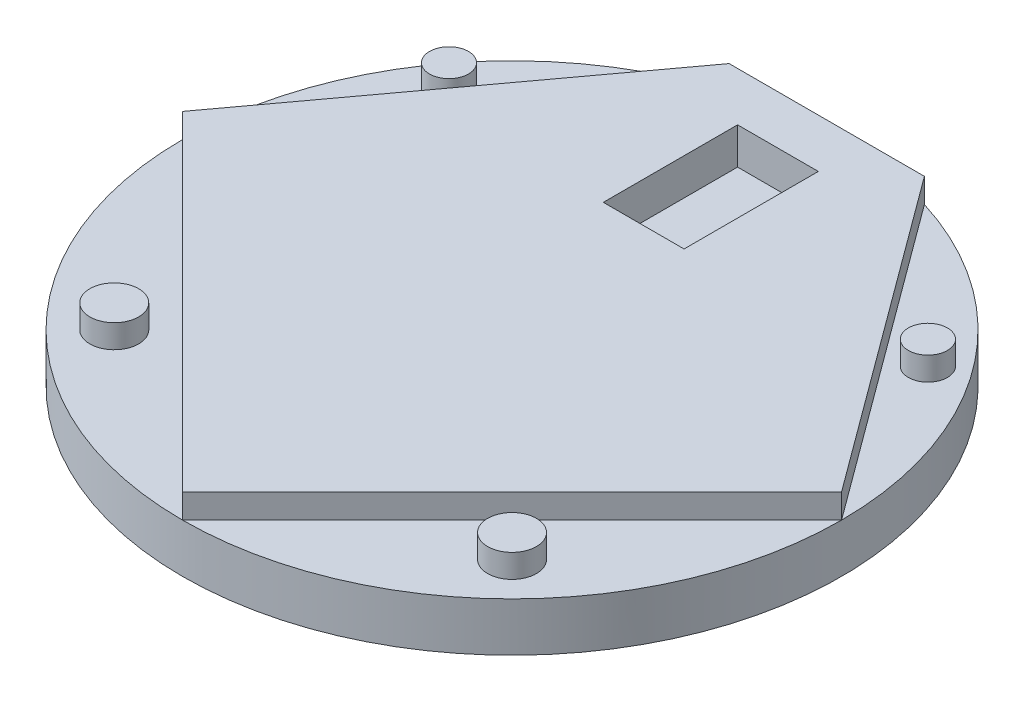
ISO-10303-21;
HEADER;
FILE_DESCRIPTION(('STEP AP214'),'2;1');
FILE_NAME('part.step','',(''),(''),'','','');
FILE_SCHEMA(('AUTOMOTIVE_DESIGN { 1 0 10303 214 1 1 1 1 }'));
ENDSEC;
DATA;
#1=APPLICATION_CONTEXT('core data for automotive mechanical design processes');
#2=APPLICATION_PROTOCOL_DEFINITION('international standard','automotive_design',2000,#1);
#3=PRODUCT_CONTEXT('',#1,'mechanical');
#4=PRODUCT('Part','Part','',(#3));
#5=PRODUCT_RELATED_PRODUCT_CATEGORY('part','',(#4));
#6=PRODUCT_DEFINITION_FORMATION('','',#4);
#7=PRODUCT_DEFINITION_CONTEXT('part definition',#1,'design');
#8=PRODUCT_DEFINITION('design','',#6,#7);
#9=PRODUCT_DEFINITION_SHAPE('','',#8);
#10=(LENGTH_UNIT() NAMED_UNIT(*) SI_UNIT(.MILLI.,.METRE.));
#11=(NAMED_UNIT(*) PLANE_ANGLE_UNIT() SI_UNIT($,.RADIAN.));
#12=(NAMED_UNIT(*) SI_UNIT($,.STERADIAN.) SOLID_ANGLE_UNIT());
#13=UNCERTAINTY_MEASURE_WITH_UNIT(LENGTH_MEASURE(1.E-05),#10,'distance_accuracy_value','');
#14=(GEOMETRIC_REPRESENTATION_CONTEXT(3) GLOBAL_UNCERTAINTY_ASSIGNED_CONTEXT((#13)) GLOBAL_UNIT_ASSIGNED_CONTEXT((#10,
#11,#12)) REPRESENTATION_CONTEXT('',''));
#15=CARTESIAN_POINT('',(0.,0.,0.));
#16=DIRECTION('',(0.,0.,1.));
#17=DIRECTION('',(1.,0.,0.));
#18=AXIS2_PLACEMENT_3D('',#15,#16,#17);
#19=CARTESIAN_POINT('',(0.,12.7,0.));
#20=DIRECTION('',(0.,1.,0.));
#21=DIRECTION('',(0.,0.,1.));
#22=AXIS2_PLACEMENT_3D('',#19,#20,#21);
#23=PLANE('',#22);
#24=CARTESIAN_POINT('',(-51.7396144086084,12.7,51.7396144086084));
#25=DIRECTION('',(0.,1.,0.));
#26=DIRECTION('',(0.,0.,1.));
#27=AXIS2_PLACEMENT_3D('',#24,#25,#26);
#28=CIRCLE('',#27,6.35);
#29=CARTESIAN_POINT('',(-51.7396144086084,12.7,58.0896144086084));
#30=VERTEX_POINT('',#29);
#31=EDGE_CURVE('E183',#30,#30,#28,.T.);
#32=ORIENTED_EDGE('',*,*,#31,.F.);
#33=EDGE_LOOP('',(#32));
#34=FACE_BOUND('',#33,.T.);
#35=DIRECTION('',(0.707106781186548,0.,0.707106781186548));
#36=VECTOR('',#35,1.);
#37=CARTESIAN_POINT('',(-85.725,12.7,0.));
#38=LINE('',#37,#36);
#39=CARTESIAN_POINT('',(-85.725,12.7,0.));
#40=VERTEX_POINT('',#39);
#41=CARTESIAN_POINT('',(0.,12.7,85.725));
#42=VERTEX_POINT('',#41);
#43=EDGE_CURVE('E63',#40,#42,#38,.T.);
#44=ORIENTED_EDGE('',*,*,#43,.F.);
#45=CARTESIAN_POINT('',(0.,12.7,0.));
#46=DIRECTION('',(0.,1.,0.));
#47=DIRECTION('',(0.,0.,1.));
#48=AXIS2_PLACEMENT_3D('',#45,#46,#47);
#49=CIRCLE('',#48,85.725);
#50=EDGE_CURVE('E49',#40,#42,#49,.T.);
#51=ORIENTED_EDGE('',*,*,#50,.T.);
#52=EDGE_LOOP('',(#44,#51));
#53=FACE_BOUND('',#52,.T.);
#54=ADVANCED_FACE('F38',(#34,#53),#23,.T.);
#55=CARTESIAN_POINT('',(-62.2888408768636,12.7,-45.8936952588359));
#56=DIRECTION('',(0.,1.,0.));
#57=DIRECTION('',(0.,0.,1.));
#58=AXIS2_PLACEMENT_3D('',#55,#56,#57);
#59=CIRCLE('',#58,5.08000000000001);
#60=CARTESIAN_POINT('',(-62.2888408768636,12.7,-40.8136952588359));
#61=VERTEX_POINT('',#60);
#62=EDGE_CURVE('E157',#61,#61,#59,.T.);
#63=ORIENTED_EDGE('',*,*,#62,.F.);
#64=EDGE_LOOP('',(#63));
#65=FACE_BOUND('',#64,.T.);
#66=DIRECTION('',(-0.593171014001739,0.,0.805076485899413));
#67=VECTOR('',#66,1.);
#68=CARTESIAN_POINT('',(-25.4,12.7,-81.8756106847454));
#69=LINE('',#68,#67);
#70=CARTESIAN_POINT('',(-25.4,12.7,-81.8756106847454));
#71=VERTEX_POINT('',#70);
#72=EDGE_CURVE('E199',#71,#40,#69,.T.);
#73=ORIENTED_EDGE('',*,*,#72,.F.);
#74=EDGE_CURVE('E254',#71,#40,#49,.T.);
#75=ORIENTED_EDGE('',*,*,#74,.T.);
#76=EDGE_LOOP('',(#73,#75));
#77=FACE_BOUND('',#76,.T.);
#78=ADVANCED_FACE('F300',(#65,#77),#23,.T.);
#79=DIRECTION('',(-1.,0.,0.));
#80=VECTOR('',#79,1.);
#81=CARTESIAN_POINT('',(-25.4,12.7,-81.8756106847454));
#82=LINE('',#81,#80);
#83=CARTESIAN_POINT('',(25.4,12.7,-81.8756106847454));
#84=VERTEX_POINT('',#83);
#85=EDGE_CURVE('E222',#84,#71,#82,.T.);
#86=ORIENTED_EDGE('',*,*,#85,.F.);
#87=EDGE_CURVE('E258',#84,#71,#49,.T.);
#88=ORIENTED_EDGE('',*,*,#87,.T.);
#89=EDGE_LOOP('',(#86,#88));
#90=FACE_BOUND('',#89,.T.);
#91=ADVANCED_FACE('F297',(#90),#23,.T.);
#92=CARTESIAN_POINT('',(62.2888408768636,12.7,-45.8936952588359));
#93=DIRECTION('',(0.,1.,0.));
#94=DIRECTION('',(0.,0.,1.));
#95=AXIS2_PLACEMENT_3D('',#92,#93,#94);
#96=CIRCLE('',#95,5.08000000000001);
#97=CARTESIAN_POINT('',(62.2888408768636,12.7,-40.8136952588359));
#98=VERTEX_POINT('',#97);
#99=EDGE_CURVE('E167',#98,#98,#96,.T.);
#100=ORIENTED_EDGE('',*,*,#99,.F.);
#101=EDGE_LOOP('',(#100));
#102=FACE_BOUND('',#101,.T.);
#103=DIRECTION('',(-0.593171014001739,0.,-0.805076485899413));
#104=VECTOR('',#103,1.);
#105=CARTESIAN_POINT('',(85.725,12.7,0.));
#106=LINE('',#105,#104);
#107=CARTESIAN_POINT('',(85.725,12.7,0.));
#108=VERTEX_POINT('',#107);
#109=EDGE_CURVE('E218',#108,#84,#106,.T.);
#110=ORIENTED_EDGE('',*,*,#109,.F.);
#111=EDGE_CURVE('E48',#108,#84,#49,.T.);
#112=ORIENTED_EDGE('',*,*,#111,.T.);
#113=EDGE_LOOP('',(#110,#112));
#114=FACE_BOUND('',#113,.T.);
#115=ADVANCED_FACE('F270',(#102,#114),#23,.T.);
#116=CARTESIAN_POINT('',(0.,12.7,0.));
#117=DIRECTION('',(0.,-1.,0.));
#118=DIRECTION('',(0.,0.,-1.));
#119=AXIS2_PLACEMENT_3D('',#116,#117,#118);
#120=CYLINDRICAL_SURFACE('',#119,85.725);
#121=EDGE_CURVE('E11',#42,#108,#49,.T.);
#122=ORIENTED_EDGE('',*,*,#121,.F.);
#123=ORIENTED_EDGE('',*,*,#50,.F.);
#124=ORIENTED_EDGE('',*,*,#74,.F.);
#125=ORIENTED_EDGE('',*,*,#87,.F.);
#126=ORIENTED_EDGE('',*,*,#111,.F.);
#127=EDGE_LOOP('',(#122,#123,#124,#125,#126));
#128=FACE_BOUND('',#127,.T.);
#129=CARTESIAN_POINT('',(0.,0.,0.));
#130=DIRECTION('',(0.,1.,0.));
#131=DIRECTION('',(0.,0.,1.));
#132=AXIS2_PLACEMENT_3D('',#129,#130,#131);
#133=CIRCLE('',#132,85.725);
#134=CARTESIAN_POINT('',(0.,0.,85.725));
#135=VERTEX_POINT('',#134);
#136=EDGE_CURVE('E42',#135,#135,#133,.T.);
#137=ORIENTED_EDGE('',*,*,#136,.T.);
#138=EDGE_LOOP('',(#137));
#139=FACE_BOUND('',#138,.T.);
#140=ADVANCED_FACE('F40',(#128,#139),#120,.T.);
#141=CARTESIAN_POINT('',(51.7396144086084,12.7,51.7396144086084));
#142=DIRECTION('',(0.,1.,0.));
#143=DIRECTION('',(0.,0.,1.));
#144=AXIS2_PLACEMENT_3D('',#141,#142,#143);
#145=CIRCLE('',#144,6.35);
#146=CARTESIAN_POINT('',(51.7396144086084,12.7,58.0896144086084));
#147=VERTEX_POINT('',#146);
#148=EDGE_CURVE('E175',#147,#147,#145,.T.);
#149=ORIENTED_EDGE('',*,*,#148,.F.);
#150=EDGE_LOOP('',(#149));
#151=FACE_BOUND('',#150,.T.);
#152=DIRECTION('',(0.707106781186548,0.,-0.707106781186548));
#153=VECTOR('',#152,1.);
#154=CARTESIAN_POINT('',(0.,12.7,85.725));
#155=LINE('',#154,#153);
#156=EDGE_CURVE('E214',#42,#108,#155,.T.);
#157=ORIENTED_EDGE('',*,*,#156,.F.);
#158=ORIENTED_EDGE('',*,*,#121,.T.);
#159=EDGE_LOOP('',(#157,#158));
#160=FACE_BOUND('',#159,.T.);
#161=ADVANCED_FACE('F288',(#151,#160),#23,.T.);
#162=CARTESIAN_POINT('',(0.,0.,0.));
#163=DIRECTION('',(0.,1.,0.));
#164=DIRECTION('',(0.,0.,1.));
#165=AXIS2_PLACEMENT_3D('',#162,#163,#164);
#166=PLANE('',#165);
#167=ORIENTED_EDGE('',*,*,#136,.F.);
#168=EDGE_LOOP('',(#167));
#169=FACE_BOUND('',#168,.T.);
#170=ADVANCED_FACE('F294',(#169),#166,.F.);
#171=CARTESIAN_POINT('',(-85.725,19.05,0.));
#172=DIRECTION('',(0.707106781186548,0.,-0.707106781186548));
#173=DIRECTION('',(-0.707106781186548,0.,-0.707106781186548));
#174=AXIS2_PLACEMENT_3D('',#171,#172,#173);
#175=PLANE('',#174);
#176=ORIENTED_EDGE('',*,*,#43,.T.);
#177=DIRECTION('',(0.,-1.,0.));
#178=VECTOR('',#177,1.);
#179=CARTESIAN_POINT('',(0.,19.05,85.725));
#180=LINE('',#179,#178);
#181=CARTESIAN_POINT('',(0.,19.05,85.725));
#182=VERTEX_POINT('',#181);
#183=EDGE_CURVE('E244',#182,#42,#180,.T.);
#184=ORIENTED_EDGE('',*,*,#183,.F.);
#185=DIRECTION('',(0.707106781186548,0.,0.707106781186548));
#186=VECTOR('',#185,1.);
#187=CARTESIAN_POINT('',(-85.725,19.05,0.));
#188=LINE('',#187,#186);
#189=CARTESIAN_POINT('',(-85.725,19.05,0.));
#190=VERTEX_POINT('',#189);
#191=EDGE_CURVE('E194',#190,#182,#188,.T.);
#192=ORIENTED_EDGE('',*,*,#191,.F.);
#193=DIRECTION('',(0.,-1.,0.));
#194=VECTOR('',#193,1.);
#195=CARTESIAN_POINT('',(-85.725,19.05,0.));
#196=LINE('',#195,#194);
#197=EDGE_CURVE('E211',#190,#40,#196,.T.);
#198=ORIENTED_EDGE('',*,*,#197,.T.);
#199=EDGE_LOOP('',(#176,#184,#192,#198));
#200=FACE_BOUND('',#199,.T.);
#201=ADVANCED_FACE('F308',(#200),#175,.F.);
#202=CARTESIAN_POINT('',(0.,19.05,85.725));
#203=DIRECTION('',(-0.707106781186548,0.,-0.707106781186548));
#204=DIRECTION('',(-0.707106781186548,0.,0.707106781186548));
#205=AXIS2_PLACEMENT_3D('',#202,#203,#204);
#206=PLANE('',#205);
#207=ORIENTED_EDGE('',*,*,#156,.T.);
#208=DIRECTION('',(0.,-1.,0.));
#209=VECTOR('',#208,1.);
#210=CARTESIAN_POINT('',(85.725,19.05,0.));
#211=LINE('',#210,#209);
#212=CARTESIAN_POINT('',(85.725,19.05,0.));
#213=VERTEX_POINT('',#212);
#214=EDGE_CURVE('E240',#213,#108,#211,.T.);
#215=ORIENTED_EDGE('',*,*,#214,.F.);
#216=DIRECTION('',(0.707106781186548,0.,-0.707106781186548));
#217=VECTOR('',#216,1.);
#218=CARTESIAN_POINT('',(0.,19.05,85.725));
#219=LINE('',#218,#217);
#220=EDGE_CURVE('E198',#182,#213,#219,.T.);
#221=ORIENTED_EDGE('',*,*,#220,.F.);
#222=ORIENTED_EDGE('',*,*,#183,.T.);
#223=EDGE_LOOP('',(#207,#215,#221,#222));
#224=FACE_BOUND('',#223,.T.);
#225=ADVANCED_FACE('F286',(#224),#206,.F.);
#226=CARTESIAN_POINT('',(85.725,19.05,0.));
#227=DIRECTION('',(-0.805076485899413,0.,0.593171014001739));
#228=DIRECTION('',(0.59317101400174,0.,0.805076485899413));
#229=AXIS2_PLACEMENT_3D('',#226,#227,#228);
#230=PLANE('',#229);
#231=ORIENTED_EDGE('',*,*,#109,.T.);
#232=DIRECTION('',(0.,-1.,0.));
#233=VECTOR('',#232,1.);
#234=CARTESIAN_POINT('',(25.4,19.05,-81.8756106847454));
#235=LINE('',#234,#233);
#236=CARTESIAN_POINT('',(25.4,19.05,-81.8756106847454));
#237=VERTEX_POINT('',#236);
#238=EDGE_CURVE('E236',#237,#84,#235,.T.);
#239=ORIENTED_EDGE('',*,*,#238,.F.);
#240=DIRECTION('',(-0.593171014001739,0.,-0.805076485899413));
#241=VECTOR('',#240,1.);
#242=CARTESIAN_POINT('',(85.725,19.05,0.));
#243=LINE('',#242,#241);
#244=EDGE_CURVE('E202',#213,#237,#243,.T.);
#245=ORIENTED_EDGE('',*,*,#244,.F.);
#246=ORIENTED_EDGE('',*,*,#214,.T.);
#247=EDGE_LOOP('',(#231,#239,#245,#246));
#248=FACE_BOUND('',#247,.T.);
#249=ADVANCED_FACE('F274',(#248),#230,.F.);
#250=CARTESIAN_POINT('',(-25.4,19.05,-81.8756106847454));
#251=DIRECTION('',(0.,0.,1.));
#252=DIRECTION('',(1.,0.,0.));
#253=AXIS2_PLACEMENT_3D('',#250,#251,#252);
#254=PLANE('',#253);
#255=ORIENTED_EDGE('',*,*,#85,.T.);
#256=DIRECTION('',(0.,-1.,0.));
#257=VECTOR('',#256,1.);
#258=CARTESIAN_POINT('',(-25.4,19.05,-81.8756106847454));
#259=LINE('',#258,#257);
#260=CARTESIAN_POINT('',(-25.4,19.05,-81.8756106847454));
#261=VERTEX_POINT('',#260);
#262=EDGE_CURVE('E232',#261,#71,#259,.T.);
#263=ORIENTED_EDGE('',*,*,#262,.F.);
#264=DIRECTION('',(-1.,0.,0.));
#265=VECTOR('',#264,1.);
#266=CARTESIAN_POINT('',(-25.4,19.05,-81.8756106847454));
#267=LINE('',#266,#265);
#268=EDGE_CURVE('E205',#237,#261,#267,.T.);
#269=ORIENTED_EDGE('',*,*,#268,.F.);
#270=ORIENTED_EDGE('',*,*,#238,.T.);
#271=EDGE_LOOP('',(#255,#263,#269,#270));
#272=FACE_BOUND('',#271,.T.);
#273=ADVANCED_FACE('F279',(#272),#254,.F.);
#274=CARTESIAN_POINT('',(-25.4,19.05,-81.8756106847454));
#275=DIRECTION('',(0.805076485899413,0.,0.593171014001739));
#276=DIRECTION('',(0.59317101400174,0.,-0.805076485899413));
#277=AXIS2_PLACEMENT_3D('',#274,#275,#276);
#278=PLANE('',#277);
#279=ORIENTED_EDGE('',*,*,#72,.T.);
#280=ORIENTED_EDGE('',*,*,#197,.F.);
#281=DIRECTION('',(-0.593171014001739,0.,0.805076485899413));
#282=VECTOR('',#281,1.);
#283=CARTESIAN_POINT('',(-25.4,19.05,-81.8756106847454));
#284=LINE('',#283,#282);
#285=EDGE_CURVE('E208',#261,#190,#284,.T.);
#286=ORIENTED_EDGE('',*,*,#285,.F.);
#287=ORIENTED_EDGE('',*,*,#262,.T.);
#288=EDGE_LOOP('',(#279,#280,#286,#287));
#289=FACE_BOUND('',#288,.T.);
#290=ADVANCED_FACE('F320',(#289),#278,.F.);
#291=CARTESIAN_POINT('',(0.,19.05,0.));
#292=DIRECTION('',(0.,1.,0.));
#293=DIRECTION('',(0.,0.,1.));
#294=AXIS2_PLACEMENT_3D('',#291,#292,#293);
#295=PLANE('',#294);
#296=DIRECTION('',(0.,0.,1.));
#297=VECTOR('',#296,1.);
#298=CARTESIAN_POINT('',(-10.5029,19.05,-69.1756106847454));
#299=LINE('',#298,#297);
#300=CARTESIAN_POINT('',(-10.5029,19.05,-69.1756106847454));
#301=VERTEX_POINT('',#300);
#302=CARTESIAN_POINT('',(-10.5029,19.05,-34.2506106847454));
#303=VERTEX_POINT('',#302);
#304=EDGE_CURVE('E56',#301,#303,#299,.T.);
#305=ORIENTED_EDGE('',*,*,#304,.F.);
#306=DIRECTION('',(-1.,0.,0.));
#307=VECTOR('',#306,1.);
#308=CARTESIAN_POINT('',(-10.5029,19.05,-69.1756106847454));
#309=LINE('',#308,#307);
#310=CARTESIAN_POINT('',(10.5029,19.05,-69.1756106847454));
#311=VERTEX_POINT('',#310);
#312=EDGE_CURVE('E135',#311,#301,#309,.T.);
#313=ORIENTED_EDGE('',*,*,#312,.F.);
#314=DIRECTION('',(0.,0.,-1.));
#315=VECTOR('',#314,1.);
#316=CARTESIAN_POINT('',(10.5029,19.05,-69.1756106847454));
#317=LINE('',#316,#315);
#318=CARTESIAN_POINT('',(10.5029,19.05,-34.2506106847454));
#319=VERTEX_POINT('',#318);
#320=EDGE_CURVE('E139',#319,#311,#317,.T.);
#321=ORIENTED_EDGE('',*,*,#320,.F.);
#322=DIRECTION('',(1.,0.,0.));
#323=VECTOR('',#322,1.);
#324=CARTESIAN_POINT('',(-10.5029,19.05,-34.2506106847454));
#325=LINE('',#324,#323);
#326=EDGE_CURVE('E148',#303,#319,#325,.T.);
#327=ORIENTED_EDGE('',*,*,#326,.F.);
#328=EDGE_LOOP('',(#305,#313,#321,#327));
#329=FACE_BOUND('',#328,.T.);
#330=ORIENTED_EDGE('',*,*,#191,.T.);
#331=ORIENTED_EDGE('',*,*,#220,.T.);
#332=ORIENTED_EDGE('',*,*,#244,.T.);
#333=ORIENTED_EDGE('',*,*,#268,.T.);
#334=ORIENTED_EDGE('',*,*,#285,.T.);
#335=EDGE_LOOP('',(#330,#331,#332,#333,#334));
#336=FACE_BOUND('',#335,.T.);
#337=ADVANCED_FACE('F283',(#329,#336),#295,.T.);
#338=CARTESIAN_POINT('',(-51.7396144086084,18.796,51.7396144086084));
#339=DIRECTION('',(0.,-1.,0.));
#340=DIRECTION('',(0.,0.,-1.));
#341=AXIS2_PLACEMENT_3D('',#338,#339,#340);
#342=CYLINDRICAL_SURFACE('',#341,6.35);
#343=CARTESIAN_POINT('',(-51.7396144086084,18.796,51.7396144086084));
#344=DIRECTION('',(0.,1.,0.));
#345=DIRECTION('',(0.,0.,1.));
#346=AXIS2_PLACEMENT_3D('',#343,#344,#345);
#347=CIRCLE('',#346,6.35);
#348=CARTESIAN_POINT('',(-51.7396144086084,18.796,58.0896144086084));
#349=VERTEX_POINT('',#348);
#350=EDGE_CURVE('E187',#349,#349,#347,.T.);
#351=ORIENTED_EDGE('',*,*,#350,.F.);
#352=EDGE_LOOP('',(#351));
#353=FACE_BOUND('',#352,.T.);
#354=ORIENTED_EDGE('',*,*,#31,.T.);
#355=EDGE_LOOP('',(#354));
#356=FACE_BOUND('',#355,.T.);
#357=ADVANCED_FACE('F327',(#353,#356),#342,.T.);
#358=CARTESIAN_POINT('',(-51.7396144086084,18.796,51.7396144086084));
#359=DIRECTION('',(0.,1.,0.));
#360=DIRECTION('',(0.,0.,1.));
#361=AXIS2_PLACEMENT_3D('',#358,#359,#360);
#362=PLANE('',#361);
#363=ORIENTED_EDGE('',*,*,#350,.T.);
#364=EDGE_LOOP('',(#363));
#365=FACE_BOUND('',#364,.T.);
#366=ADVANCED_FACE('F383',(#365),#362,.T.);
#367=CARTESIAN_POINT('',(51.7396144086084,18.796,51.7396144086084));
#368=DIRECTION('',(0.,-1.,0.));
#369=DIRECTION('',(0.,0.,-1.));
#370=AXIS2_PLACEMENT_3D('',#367,#368,#369);
#371=CYLINDRICAL_SURFACE('',#370,6.35);
#372=CARTESIAN_POINT('',(51.7396144086084,18.796,51.7396144086084));
#373=DIRECTION('',(0.,1.,0.));
#374=DIRECTION('',(0.,0.,1.));
#375=AXIS2_PLACEMENT_3D('',#372,#373,#374);
#376=CIRCLE('',#375,6.35);
#377=CARTESIAN_POINT('',(51.7396144086084,18.796,58.0896144086084));
#378=VERTEX_POINT('',#377);
#379=EDGE_CURVE('E179',#378,#378,#376,.T.);
#380=ORIENTED_EDGE('',*,*,#379,.F.);
#381=EDGE_LOOP('',(#380));
#382=FACE_BOUND('',#381,.T.);
#383=ORIENTED_EDGE('',*,*,#148,.T.);
#384=EDGE_LOOP('',(#383));
#385=FACE_BOUND('',#384,.T.);
#386=ADVANCED_FACE('F392',(#382,#385),#371,.T.);
#387=CARTESIAN_POINT('',(51.7396144086084,18.796,51.7396144086084));
#388=DIRECTION('',(0.,1.,0.));
#389=DIRECTION('',(0.,0.,1.));
#390=AXIS2_PLACEMENT_3D('',#387,#388,#389);
#391=PLANE('',#390);
#392=ORIENTED_EDGE('',*,*,#379,.T.);
#393=EDGE_LOOP('',(#392));
#394=FACE_BOUND('',#393,.T.);
#395=ADVANCED_FACE('F402',(#394),#391,.T.);
#396=CARTESIAN_POINT('',(62.2888408768636,18.796,-45.8936952588359));
#397=DIRECTION('',(0.,-1.,0.));
#398=DIRECTION('',(0.,0.,-1.));
#399=AXIS2_PLACEMENT_3D('',#396,#397,#398);
#400=CYLINDRICAL_SURFACE('',#399,5.08000000000001);
#401=CARTESIAN_POINT('',(62.2888408768636,18.796,-45.8936952588359));
#402=DIRECTION('',(0.,1.,0.));
#403=DIRECTION('',(0.,0.,1.));
#404=AXIS2_PLACEMENT_3D('',#401,#402,#403);
#405=CIRCLE('',#404,5.08000000000001);
#406=CARTESIAN_POINT('',(62.2888408768636,18.796,-40.8136952588359));
#407=VERTEX_POINT('',#406);
#408=EDGE_CURVE('E171',#407,#407,#405,.T.);
#409=ORIENTED_EDGE('',*,*,#408,.F.);
#410=EDGE_LOOP('',(#409));
#411=FACE_BOUND('',#410,.T.);
#412=ORIENTED_EDGE('',*,*,#99,.T.);
#413=EDGE_LOOP('',(#412));
#414=FACE_BOUND('',#413,.T.);
#415=ADVANCED_FACE('F412',(#411,#414),#400,.T.);
#416=CARTESIAN_POINT('',(62.2888408768636,18.796,-45.8936952588359));
#417=DIRECTION('',(0.,1.,0.));
#418=DIRECTION('',(0.,0.,1.));
#419=AXIS2_PLACEMENT_3D('',#416,#417,#418);
#420=PLANE('',#419);
#421=ORIENTED_EDGE('',*,*,#408,.T.);
#422=EDGE_LOOP('',(#421));
#423=FACE_BOUND('',#422,.T.);
#424=ADVANCED_FACE('F422',(#423),#420,.T.);
#425=CARTESIAN_POINT('',(-62.2888408768636,18.796,-45.8936952588359));
#426=DIRECTION('',(0.,-1.,0.));
#427=DIRECTION('',(0.,0.,-1.));
#428=AXIS2_PLACEMENT_3D('',#425,#426,#427);
#429=CYLINDRICAL_SURFACE('',#428,5.08000000000001);
#430=CARTESIAN_POINT('',(-62.2888408768636,18.796,-45.8936952588359));
#431=DIRECTION('',(0.,1.,0.));
#432=DIRECTION('',(0.,0.,1.));
#433=AXIS2_PLACEMENT_3D('',#430,#431,#432);
#434=CIRCLE('',#433,5.08000000000001);
#435=CARTESIAN_POINT('',(-62.2888408768636,18.796,-40.8136952588359));
#436=VERTEX_POINT('',#435);
#437=EDGE_CURVE('E163',#436,#436,#434,.T.);
#438=ORIENTED_EDGE('',*,*,#437,.F.);
#439=EDGE_LOOP('',(#438));
#440=FACE_BOUND('',#439,.T.);
#441=ORIENTED_EDGE('',*,*,#62,.T.);
#442=EDGE_LOOP('',(#441));
#443=FACE_BOUND('',#442,.T.);
#444=ADVANCED_FACE('F432',(#440,#443),#429,.T.);
#445=CARTESIAN_POINT('',(-62.2888408768636,18.796,-45.8936952588359));
#446=DIRECTION('',(0.,1.,0.));
#447=DIRECTION('',(0.,0.,1.));
#448=AXIS2_PLACEMENT_3D('',#445,#446,#447);
#449=PLANE('',#448);
#450=ORIENTED_EDGE('',*,*,#437,.T.);
#451=EDGE_LOOP('',(#450));
#452=FACE_BOUND('',#451,.T.);
#453=ADVANCED_FACE('F442',(#452),#449,.T.);
#454=CARTESIAN_POINT('',(-10.5029,9.525,-69.1756106847454));
#455=DIRECTION('',(-1.,0.,0.));
#456=DIRECTION('',(0.,0.,1.));
#457=AXIS2_PLACEMENT_3D('',#454,#455,#456);
#458=PLANE('',#457);
#459=ORIENTED_EDGE('',*,*,#304,.T.);
#460=DIRECTION('',(0.,1.,0.));
#461=VECTOR('',#460,1.);
#462=CARTESIAN_POINT('',(-10.5029,9.525,-34.2506106847454));
#463=LINE('',#462,#461);
#464=CARTESIAN_POINT('',(-10.5029,9.525,-34.2506106847454));
#465=VERTEX_POINT('',#464);
#466=EDGE_CURVE('E110',#465,#303,#463,.T.);
#467=ORIENTED_EDGE('',*,*,#466,.F.);
#468=DIRECTION('',(0.,0.,1.));
#469=VECTOR('',#468,1.);
#470=CARTESIAN_POINT('',(-10.5029,9.525,-69.1756106847454));
#471=LINE('',#470,#469);
#472=CARTESIAN_POINT('',(-10.5029,9.525,-69.1756106847454));
#473=VERTEX_POINT('',#472);
#474=EDGE_CURVE('E114',#473,#465,#471,.T.);
#475=ORIENTED_EDGE('',*,*,#474,.F.);
#476=DIRECTION('',(0.,1.,0.));
#477=VECTOR('',#476,1.);
#478=CARTESIAN_POINT('',(-10.5029,9.525,-69.1756106847454));
#479=LINE('',#478,#477);
#480=EDGE_CURVE('E154',#473,#301,#479,.T.);
#481=ORIENTED_EDGE('',*,*,#480,.T.);
#482=EDGE_LOOP('',(#459,#467,#475,#481));
#483=FACE_BOUND('',#482,.T.);
#484=ADVANCED_FACE('F112',(#483),#458,.F.);
#485=CARTESIAN_POINT('',(-10.5029,9.525,-69.1756106847454));
#486=DIRECTION('',(0.,0.,-1.));
#487=DIRECTION('',(-1.,0.,0.));
#488=AXIS2_PLACEMENT_3D('',#485,#486,#487);
#489=PLANE('',#488);
#490=ORIENTED_EDGE('',*,*,#312,.T.);
#491=ORIENTED_EDGE('',*,*,#480,.F.);
#492=DIRECTION('',(-1.,0.,0.));
#493=VECTOR('',#492,1.);
#494=CARTESIAN_POINT('',(-10.5029,9.525,-69.1756106847454));
#495=LINE('',#494,#493);
#496=CARTESIAN_POINT('',(10.5029,9.525,-69.1756106847454));
#497=VERTEX_POINT('',#496);
#498=EDGE_CURVE('E121',#497,#473,#495,.T.);
#499=ORIENTED_EDGE('',*,*,#498,.F.);
#500=DIRECTION('',(0.,1.,0.));
#501=VECTOR('',#500,1.);
#502=CARTESIAN_POINT('',(10.5029,9.525,-69.1756106847454));
#503=LINE('',#502,#501);
#504=EDGE_CURVE('E158',#497,#311,#503,.T.);
#505=ORIENTED_EDGE('',*,*,#504,.T.);
#506=EDGE_LOOP('',(#490,#491,#499,#505));
#507=FACE_BOUND('',#506,.T.);
#508=ADVANCED_FACE('F466',(#507),#489,.F.);
#509=CARTESIAN_POINT('',(10.5029,9.525,-69.1756106847454));
#510=DIRECTION('',(1.,0.,0.));
#511=DIRECTION('',(0.,0.,-1.));
#512=AXIS2_PLACEMENT_3D('',#509,#510,#511);
#513=PLANE('',#512);
#514=ORIENTED_EDGE('',*,*,#320,.T.);
#515=ORIENTED_EDGE('',*,*,#504,.F.);
#516=DIRECTION('',(0.,0.,-1.));
#517=VECTOR('',#516,1.);
#518=CARTESIAN_POINT('',(10.5029,9.525,-69.1756106847454));
#519=LINE('',#518,#517);
#520=CARTESIAN_POINT('',(10.5029,9.525,-34.2506106847454));
#521=VERTEX_POINT('',#520);
#522=EDGE_CURVE('E130',#521,#497,#519,.T.);
#523=ORIENTED_EDGE('',*,*,#522,.F.);
#524=DIRECTION('',(0.,1.,0.));
#525=VECTOR('',#524,1.);
#526=CARTESIAN_POINT('',(10.5029,9.525,-34.2506106847454));
#527=LINE('',#526,#525);
#528=EDGE_CURVE('E120',#521,#319,#527,.T.);
#529=ORIENTED_EDGE('',*,*,#528,.T.);
#530=EDGE_LOOP('',(#514,#515,#523,#529));
#531=FACE_BOUND('',#530,.T.);
#532=ADVANCED_FACE('F475',(#531),#513,.F.);
#533=CARTESIAN_POINT('',(-10.5029,9.525,-34.2506106847454));
#534=DIRECTION('',(0.,0.,1.));
#535=DIRECTION('',(1.,0.,0.));
#536=AXIS2_PLACEMENT_3D('',#533,#534,#535);
#537=PLANE('',#536);
#538=ORIENTED_EDGE('',*,*,#326,.T.);
#539=ORIENTED_EDGE('',*,*,#528,.F.);
#540=DIRECTION('',(1.,0.,0.));
#541=VECTOR('',#540,1.);
#542=CARTESIAN_POINT('',(-10.5029,9.525,-34.2506106847454));
#543=LINE('',#542,#541);
#544=EDGE_CURVE('E124',#465,#521,#543,.T.);
#545=ORIENTED_EDGE('',*,*,#544,.F.);
#546=ORIENTED_EDGE('',*,*,#466,.T.);
#547=EDGE_LOOP('',(#538,#539,#545,#546));
#548=FACE_BOUND('',#547,.T.);
#549=ADVANCED_FACE('F125',(#548),#537,.F.);
#550=CARTESIAN_POINT('',(0.,9.525,0.));
#551=DIRECTION('',(0.,1.,0.));
#552=DIRECTION('',(0.,0.,1.));
#553=AXIS2_PLACEMENT_3D('',#550,#551,#552);
#554=PLANE('',#553);
#555=ORIENTED_EDGE('',*,*,#474,.T.);
#556=ORIENTED_EDGE('',*,*,#544,.T.);
#557=ORIENTED_EDGE('',*,*,#522,.T.);
#558=ORIENTED_EDGE('',*,*,#498,.T.);
#559=EDGE_LOOP('',(#555,#556,#557,#558));
#560=FACE_BOUND('',#559,.T.);
#561=ADVANCED_FACE('F132',(#560),#554,.T.);
#562=CLOSED_SHELL('',(#54,#78,#91,#115,#140,#161,#170,#201,#225,#249,#273,#290,#337,#357,#366,
#386,#395,#415,#424,#444,#453,#484,#508,#532,#549,#561));
#563=MANIFOLD_SOLID_BREP('B2',#562);
#564=ADVANCED_BREP_SHAPE_REPRESENTATION('',(#18,#563),#14);
#565=SHAPE_DEFINITION_REPRESENTATION(#9,#564);
ENDSEC;
END-ISO-10303-21;
